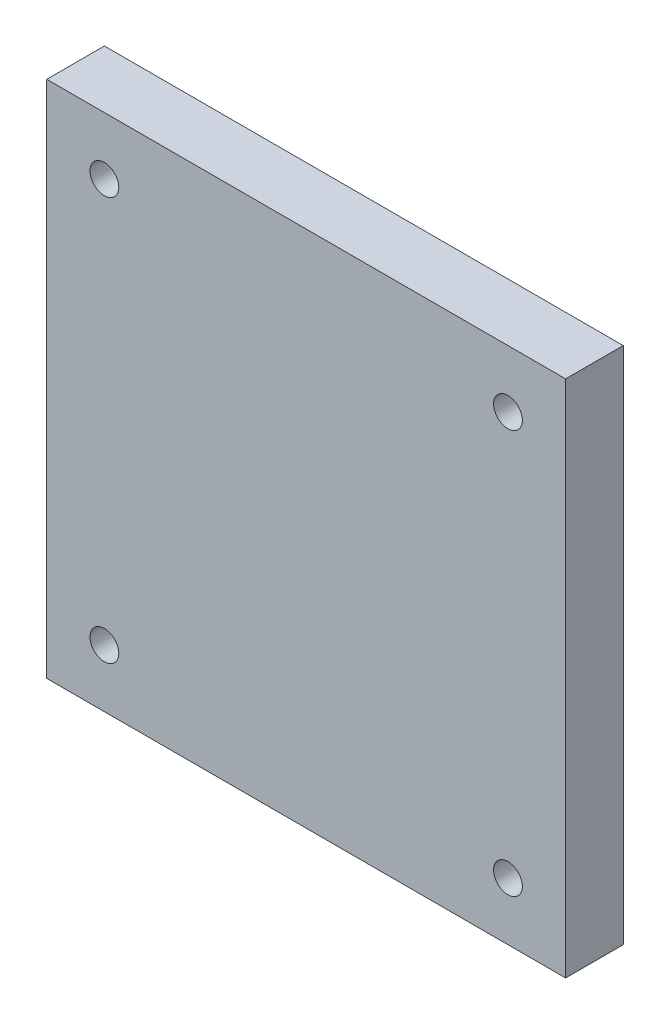
ISO-10303-21;
HEADER;
FILE_DESCRIPTION(('STEP AP214'),'2;1');
FILE_NAME('part.step','',(''),(''),'','','');
FILE_SCHEMA(('AUTOMOTIVE_DESIGN { 1 0 10303 214 1 1 1 1 }'));
ENDSEC;
DATA;
#1=APPLICATION_CONTEXT('core data for automotive mechanical design processes');
#2=APPLICATION_PROTOCOL_DEFINITION('international standard','automotive_design',2000,#1);
#3=PRODUCT_CONTEXT('',#1,'mechanical');
#4=PRODUCT('Part','Part','',(#3));
#5=PRODUCT_RELATED_PRODUCT_CATEGORY('part','',(#4));
#6=PRODUCT_DEFINITION_FORMATION('','',#4);
#7=PRODUCT_DEFINITION_CONTEXT('part definition',#1,'design');
#8=PRODUCT_DEFINITION('design','',#6,#7);
#9=PRODUCT_DEFINITION_SHAPE('','',#8);
#10=(LENGTH_UNIT() NAMED_UNIT(*) SI_UNIT(.MILLI.,.METRE.));
#11=(NAMED_UNIT(*) PLANE_ANGLE_UNIT() SI_UNIT($,.RADIAN.));
#12=(NAMED_UNIT(*) SI_UNIT($,.STERADIAN.) SOLID_ANGLE_UNIT());
#13=UNCERTAINTY_MEASURE_WITH_UNIT(LENGTH_MEASURE(1.E-05),#10,'distance_accuracy_value','');
#14=(GEOMETRIC_REPRESENTATION_CONTEXT(3) GLOBAL_UNCERTAINTY_ASSIGNED_CONTEXT((#13)) GLOBAL_UNIT_ASSIGNED_CONTEXT((#10,
#11,#12)) REPRESENTATION_CONTEXT('',''));
#15=CARTESIAN_POINT('',(0.,0.,0.));
#16=DIRECTION('',(0.,0.,1.));
#17=DIRECTION('',(1.,0.,0.));
#18=AXIS2_PLACEMENT_3D('',#15,#16,#17);
#19=CARTESIAN_POINT('',(0.,45.,5.));
#20=DIRECTION('',(1.,0.,0.));
#21=DIRECTION('',(0.,1.,0.));
#22=AXIS2_PLACEMENT_3D('',#19,#20,#21);
#23=PLANE('',#22);
#24=DIRECTION('',(0.,-1.,0.));
#25=VECTOR('',#24,1.);
#26=CARTESIAN_POINT('',(0.,45.,0.));
#27=LINE('',#26,#25);
#28=CARTESIAN_POINT('',(0.,45.,0.));
#29=VERTEX_POINT('',#28);
#30=CARTESIAN_POINT('',(0.,0.,0.));
#31=VERTEX_POINT('',#30);
#32=EDGE_CURVE('E97',#29,#31,#27,.T.);
#33=ORIENTED_EDGE('',*,*,#32,.T.);
#34=DIRECTION('',(0.,0.,-1.));
#35=VECTOR('',#34,1.);
#36=CARTESIAN_POINT('',(0.,0.,5.));
#37=LINE('',#36,#35);
#38=CARTESIAN_POINT('',(0.,0.,5.));
#39=VERTEX_POINT('',#38);
#40=EDGE_CURVE('E11',#39,#31,#37,.T.);
#41=ORIENTED_EDGE('',*,*,#40,.F.);
#42=DIRECTION('',(0.,-1.,0.));
#43=VECTOR('',#42,1.);
#44=CARTESIAN_POINT('',(0.,45.,5.));
#45=LINE('',#44,#43);
#46=CARTESIAN_POINT('',(0.,45.,5.));
#47=VERTEX_POINT('',#46);
#48=EDGE_CURVE('E84',#47,#39,#45,.T.);
#49=ORIENTED_EDGE('',*,*,#48,.F.);
#50=DIRECTION('',(0.,0.,-1.));
#51=VECTOR('',#50,1.);
#52=CARTESIAN_POINT('',(0.,45.,5.));
#53=LINE('',#52,#51);
#54=EDGE_CURVE('E93',#47,#29,#53,.T.);
#55=ORIENTED_EDGE('',*,*,#54,.T.);
#56=EDGE_LOOP('',(#33,#41,#49,#55));
#57=FACE_BOUND('',#56,.T.);
#58=ADVANCED_FACE('F31',(#57),#23,.F.);
#59=CARTESIAN_POINT('',(0.,0.,5.));
#60=DIRECTION('',(0.,1.,0.));
#61=DIRECTION('',(0.,0.,1.));
#62=AXIS2_PLACEMENT_3D('',#59,#60,#61);
#63=PLANE('',#62);
#64=DIRECTION('',(1.,0.,0.));
#65=VECTOR('',#64,1.);
#66=CARTESIAN_POINT('',(0.,0.,0.));
#67=LINE('',#66,#65);
#68=CARTESIAN_POINT('',(45.,0.,0.));
#69=VERTEX_POINT('',#68);
#70=EDGE_CURVE('E88',#31,#69,#67,.T.);
#71=ORIENTED_EDGE('',*,*,#70,.T.);
#72=DIRECTION('',(0.,0.,-1.));
#73=VECTOR('',#72,1.);
#74=CARTESIAN_POINT('',(45.,0.,5.));
#75=LINE('',#74,#73);
#76=CARTESIAN_POINT('',(45.,0.,5.));
#77=VERTEX_POINT('',#76);
#78=EDGE_CURVE('E40',#77,#69,#75,.T.);
#79=ORIENTED_EDGE('',*,*,#78,.F.);
#80=DIRECTION('',(1.,0.,0.));
#81=VECTOR('',#80,1.);
#82=CARTESIAN_POINT('',(0.,0.,5.));
#83=LINE('',#82,#81);
#84=EDGE_CURVE('E79',#39,#77,#83,.T.);
#85=ORIENTED_EDGE('',*,*,#84,.F.);
#86=ORIENTED_EDGE('',*,*,#40,.T.);
#87=EDGE_LOOP('',(#71,#79,#85,#86));
#88=FACE_BOUND('',#87,.T.);
#89=ADVANCED_FACE('F87',(#88),#63,.F.);
#90=CARTESIAN_POINT('',(45.,45.,5.));
#91=DIRECTION('',(-1.,0.,0.));
#92=DIRECTION('',(0.,-1.,0.));
#93=AXIS2_PLACEMENT_3D('',#90,#91,#92);
#94=PLANE('',#93);
#95=DIRECTION('',(0.,1.,0.));
#96=VECTOR('',#95,1.);
#97=CARTESIAN_POINT('',(45.,45.,0.));
#98=LINE('',#97,#96);
#99=CARTESIAN_POINT('',(45.,45.,0.));
#100=VERTEX_POINT('',#99);
#101=EDGE_CURVE('E66',#69,#100,#98,.T.);
#102=ORIENTED_EDGE('',*,*,#101,.T.);
#103=DIRECTION('',(0.,0.,-1.));
#104=VECTOR('',#103,1.);
#105=CARTESIAN_POINT('',(45.,45.,5.));
#106=LINE('',#105,#104);
#107=CARTESIAN_POINT('',(45.,45.,5.));
#108=VERTEX_POINT('',#107);
#109=EDGE_CURVE('E89',#108,#100,#106,.T.);
#110=ORIENTED_EDGE('',*,*,#109,.F.);
#111=DIRECTION('',(0.,1.,0.));
#112=VECTOR('',#111,1.);
#113=CARTESIAN_POINT('',(45.,45.,5.));
#114=LINE('',#113,#112);
#115=EDGE_CURVE('E82',#77,#108,#114,.T.);
#116=ORIENTED_EDGE('',*,*,#115,.F.);
#117=ORIENTED_EDGE('',*,*,#78,.T.);
#118=EDGE_LOOP('',(#102,#110,#116,#117));
#119=FACE_BOUND('',#118,.T.);
#120=ADVANCED_FACE('F91',(#119),#94,.F.);
#121=CARTESIAN_POINT('',(0.,45.,5.));
#122=DIRECTION('',(0.,-1.,0.));
#123=DIRECTION('',(0.,0.,-1.));
#124=AXIS2_PLACEMENT_3D('',#121,#122,#123);
#125=PLANE('',#124);
#126=DIRECTION('',(-1.,0.,0.));
#127=VECTOR('',#126,1.);
#128=CARTESIAN_POINT('',(0.,45.,0.));
#129=LINE('',#128,#127);
#130=EDGE_CURVE('E72',#100,#29,#129,.T.);
#131=ORIENTED_EDGE('',*,*,#130,.T.);
#132=ORIENTED_EDGE('',*,*,#54,.F.);
#133=DIRECTION('',(-1.,0.,0.));
#134=VECTOR('',#133,1.);
#135=CARTESIAN_POINT('',(0.,45.,5.));
#136=LINE('',#135,#134);
#137=EDGE_CURVE('E49',#108,#47,#136,.T.);
#138=ORIENTED_EDGE('',*,*,#137,.F.);
#139=ORIENTED_EDGE('',*,*,#109,.T.);
#140=EDGE_LOOP('',(#131,#132,#138,#139));
#141=FACE_BOUND('',#140,.T.);
#142=ADVANCED_FACE('F154',(#141),#125,.F.);
#143=CARTESIAN_POINT('',(0.,0.,5.));
#144=DIRECTION('',(0.,0.,1.));
#145=DIRECTION('',(1.,0.,0.));
#146=AXIS2_PLACEMENT_3D('',#143,#144,#145);
#147=PLANE('',#146);
#148=CARTESIAN_POINT('',(5.,40.,5.));
#149=DIRECTION('',(0.,0.,1.));
#150=DIRECTION('',(1.,0.,0.));
#151=AXIS2_PLACEMENT_3D('',#148,#149,#150);
#152=CIRCLE('',#151,1.25);
#153=CARTESIAN_POINT('',(6.25,40.,5.));
#154=VERTEX_POINT('',#153);
#155=EDGE_CURVE('E122',#154,#154,#152,.T.);
#156=ORIENTED_EDGE('',*,*,#155,.F.);
#157=EDGE_LOOP('',(#156));
#158=FACE_BOUND('',#157,.T.);
#159=CARTESIAN_POINT('',(40.,5.,5.));
#160=DIRECTION('',(0.,0.,1.));
#161=DIRECTION('',(1.,0.,0.));
#162=AXIS2_PLACEMENT_3D('',#159,#160,#161);
#163=CIRCLE('',#162,1.25);
#164=CARTESIAN_POINT('',(41.25,5.,5.));
#165=VERTEX_POINT('',#164);
#166=EDGE_CURVE('E112',#165,#165,#163,.T.);
#167=ORIENTED_EDGE('',*,*,#166,.F.);
#168=EDGE_LOOP('',(#167));
#169=FACE_BOUND('',#168,.T.);
#170=CARTESIAN_POINT('',(40.,40.,5.));
#171=DIRECTION('',(0.,0.,1.));
#172=DIRECTION('',(1.,0.,0.));
#173=AXIS2_PLACEMENT_3D('',#170,#171,#172);
#174=CIRCLE('',#173,1.25);
#175=CARTESIAN_POINT('',(41.25,40.,5.));
#176=VERTEX_POINT('',#175);
#177=EDGE_CURVE('E109',#176,#176,#174,.T.);
#178=ORIENTED_EDGE('',*,*,#177,.F.);
#179=EDGE_LOOP('',(#178));
#180=FACE_BOUND('',#179,.T.);
#181=CARTESIAN_POINT('',(4.99999999999999,5.,5.));
#182=DIRECTION('',(0.,0.,1.));
#183=DIRECTION('',(1.,0.,0.));
#184=AXIS2_PLACEMENT_3D('',#181,#182,#183);
#185=CIRCLE('',#184,1.25);
#186=CARTESIAN_POINT('',(6.24999999999999,5.,5.));
#187=VERTEX_POINT('',#186);
#188=EDGE_CURVE('E108',#187,#187,#185,.T.);
#189=ORIENTED_EDGE('',*,*,#188,.F.);
#190=EDGE_LOOP('',(#189));
#191=FACE_BOUND('',#190,.T.);
#192=ORIENTED_EDGE('',*,*,#48,.T.);
#193=ORIENTED_EDGE('',*,*,#84,.T.);
#194=ORIENTED_EDGE('',*,*,#115,.T.);
#195=ORIENTED_EDGE('',*,*,#137,.T.);
#196=EDGE_LOOP('',(#192,#193,#194,#195));
#197=FACE_BOUND('',#196,.T.);
#198=ADVANCED_FACE('F80',(#158,#169,#180,#191,#197),#147,.T.);
#199=CARTESIAN_POINT('',(0.,0.,0.));
#200=DIRECTION('',(0.,0.,1.));
#201=DIRECTION('',(1.,0.,0.));
#202=AXIS2_PLACEMENT_3D('',#199,#200,#201);
#203=PLANE('',#202);
#204=CARTESIAN_POINT('',(5.,40.,0.));
#205=DIRECTION('',(0.,0.,1.));
#206=DIRECTION('',(1.,0.,0.));
#207=AXIS2_PLACEMENT_3D('',#204,#205,#206);
#208=CIRCLE('',#207,1.25);
#209=CARTESIAN_POINT('',(6.25,40.,0.));
#210=VERTEX_POINT('',#209);
#211=EDGE_CURVE('E34',#210,#210,#208,.T.);
#212=ORIENTED_EDGE('',*,*,#211,.T.);
#213=EDGE_LOOP('',(#212));
#214=FACE_BOUND('',#213,.T.);
#215=CARTESIAN_POINT('',(40.,5.,0.));
#216=DIRECTION('',(0.,0.,1.));
#217=DIRECTION('',(1.,0.,0.));
#218=AXIS2_PLACEMENT_3D('',#215,#216,#217);
#219=CIRCLE('',#218,1.25);
#220=CARTESIAN_POINT('',(41.25,5.,0.));
#221=VERTEX_POINT('',#220);
#222=EDGE_CURVE('E110',#221,#221,#219,.T.);
#223=ORIENTED_EDGE('',*,*,#222,.T.);
#224=EDGE_LOOP('',(#223));
#225=FACE_BOUND('',#224,.T.);
#226=CARTESIAN_POINT('',(40.,40.,0.));
#227=DIRECTION('',(0.,0.,1.));
#228=DIRECTION('',(1.,0.,0.));
#229=AXIS2_PLACEMENT_3D('',#226,#227,#228);
#230=CIRCLE('',#229,1.25);
#231=CARTESIAN_POINT('',(41.25,40.,0.));
#232=VERTEX_POINT('',#231);
#233=EDGE_CURVE('E106',#232,#232,#230,.T.);
#234=ORIENTED_EDGE('',*,*,#233,.T.);
#235=EDGE_LOOP('',(#234));
#236=FACE_BOUND('',#235,.T.);
#237=CARTESIAN_POINT('',(4.99999999999999,5.,0.));
#238=DIRECTION('',(0.,0.,1.));
#239=DIRECTION('',(1.,0.,0.));
#240=AXIS2_PLACEMENT_3D('',#237,#238,#239);
#241=CIRCLE('',#240,1.25);
#242=CARTESIAN_POINT('',(6.24999999999999,5.,0.));
#243=VERTEX_POINT('',#242);
#244=EDGE_CURVE('E100',#243,#243,#241,.T.);
#245=ORIENTED_EDGE('',*,*,#244,.T.);
#246=EDGE_LOOP('',(#245));
#247=FACE_BOUND('',#246,.T.);
#248=ORIENTED_EDGE('',*,*,#32,.F.);
#249=ORIENTED_EDGE('',*,*,#130,.F.);
#250=ORIENTED_EDGE('',*,*,#101,.F.);
#251=ORIENTED_EDGE('',*,*,#70,.F.);
#252=EDGE_LOOP('',(#248,#249,#250,#251));
#253=FACE_BOUND('',#252,.T.);
#254=ADVANCED_FACE('F130',(#214,#225,#236,#247,#253),#203,.F.);
#255=CARTESIAN_POINT('',(4.99999999999999,5.,5.));
#256=DIRECTION('',(0.,0.,1.));
#257=DIRECTION('',(1.,0.,0.));
#258=AXIS2_PLACEMENT_3D('',#255,#256,#257);
#259=CYLINDRICAL_SURFACE('',#258,1.25);
#260=ORIENTED_EDGE('',*,*,#188,.T.);
#261=EDGE_LOOP('',(#260));
#262=FACE_BOUND('',#261,.T.);
#263=ORIENTED_EDGE('',*,*,#244,.F.);
#264=EDGE_LOOP('',(#263));
#265=FACE_BOUND('',#264,.T.);
#266=ADVANCED_FACE('F133',(#262,#265),#259,.F.);
#267=CARTESIAN_POINT('',(40.,40.,5.));
#268=DIRECTION('',(0.,0.,1.));
#269=DIRECTION('',(1.,0.,0.));
#270=AXIS2_PLACEMENT_3D('',#267,#268,#269);
#271=CYLINDRICAL_SURFACE('',#270,1.25);
#272=ORIENTED_EDGE('',*,*,#177,.T.);
#273=EDGE_LOOP('',(#272));
#274=FACE_BOUND('',#273,.T.);
#275=ORIENTED_EDGE('',*,*,#233,.F.);
#276=EDGE_LOOP('',(#275));
#277=FACE_BOUND('',#276,.T.);
#278=ADVANCED_FACE('F135',(#274,#277),#271,.F.);
#279=CARTESIAN_POINT('',(40.,5.,5.));
#280=DIRECTION('',(0.,0.,1.));
#281=DIRECTION('',(1.,0.,0.));
#282=AXIS2_PLACEMENT_3D('',#279,#280,#281);
#283=CYLINDRICAL_SURFACE('',#282,1.25);
#284=ORIENTED_EDGE('',*,*,#166,.T.);
#285=EDGE_LOOP('',(#284));
#286=FACE_BOUND('',#285,.T.);
#287=ORIENTED_EDGE('',*,*,#222,.F.);
#288=EDGE_LOOP('',(#287));
#289=FACE_BOUND('',#288,.T.);
#290=ADVANCED_FACE('F142',(#286,#289),#283,.F.);
#291=CARTESIAN_POINT('',(5.,40.,5.));
#292=DIRECTION('',(0.,0.,1.));
#293=DIRECTION('',(1.,0.,0.));
#294=AXIS2_PLACEMENT_3D('',#291,#292,#293);
#295=CYLINDRICAL_SURFACE('',#294,1.25);
#296=ORIENTED_EDGE('',*,*,#155,.T.);
#297=EDGE_LOOP('',(#296));
#298=FACE_BOUND('',#297,.T.);
#299=ORIENTED_EDGE('',*,*,#211,.F.);
#300=EDGE_LOOP('',(#299));
#301=FACE_BOUND('',#300,.T.);
#302=ADVANCED_FACE('F208',(#298,#301),#295,.F.);
#303=CLOSED_SHELL('',(#58,#89,#120,#142,#198,#254,#266,#278,#290,#302));
#304=MANIFOLD_SOLID_BREP('B2',#303);
#305=ADVANCED_BREP_SHAPE_REPRESENTATION('',(#18,#304),#14);
#306=SHAPE_DEFINITION_REPRESENTATION(#9,#305);
ENDSEC;
END-ISO-10303-21;
